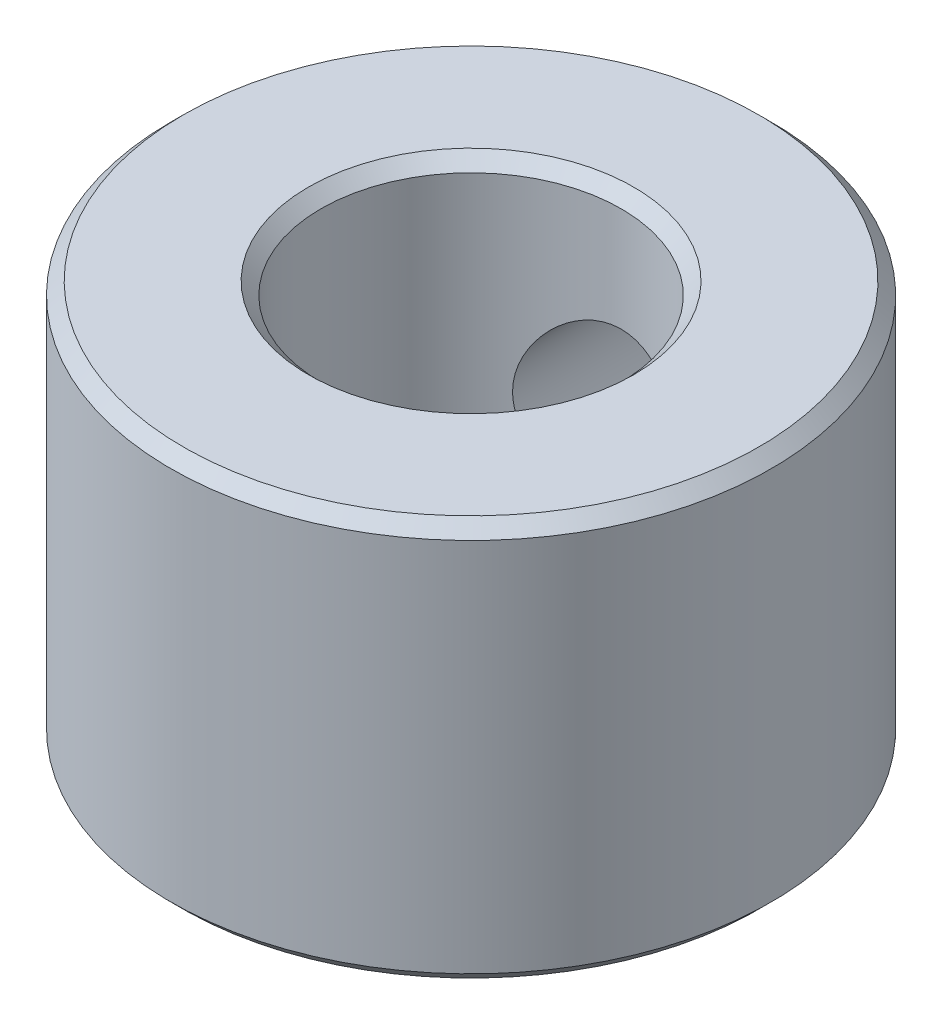
ISO-10303-21;
HEADER;
FILE_DESCRIPTION(('STEP AP214'),'2;1');
FILE_NAME('part.step','',(''),(''),'','','');
FILE_SCHEMA(('AUTOMOTIVE_DESIGN { 1 0 10303 214 1 1 1 1 }'));
ENDSEC;
DATA;
#1=APPLICATION_CONTEXT('core data for automotive mechanical design processes');
#2=APPLICATION_PROTOCOL_DEFINITION('international standard','automotive_design',2000,#1);
#3=PRODUCT_CONTEXT('',#1,'mechanical');
#4=PRODUCT('Part','Part','',(#3));
#5=PRODUCT_RELATED_PRODUCT_CATEGORY('part','',(#4));
#6=PRODUCT_DEFINITION_FORMATION('','',#4);
#7=PRODUCT_DEFINITION_CONTEXT('part definition',#1,'design');
#8=PRODUCT_DEFINITION('design','',#6,#7);
#9=PRODUCT_DEFINITION_SHAPE('','',#8);
#10=(LENGTH_UNIT() NAMED_UNIT(*) SI_UNIT(.MILLI.,.METRE.));
#11=(NAMED_UNIT(*) PLANE_ANGLE_UNIT() SI_UNIT($,.RADIAN.));
#12=(NAMED_UNIT(*) SI_UNIT($,.STERADIAN.) SOLID_ANGLE_UNIT());
#13=UNCERTAINTY_MEASURE_WITH_UNIT(LENGTH_MEASURE(1.E-05),#10,'distance_accuracy_value','');
#14=(GEOMETRIC_REPRESENTATION_CONTEXT(3) GLOBAL_UNCERTAINTY_ASSIGNED_CONTEXT((#13)) GLOBAL_UNIT_ASSIGNED_CONTEXT((#10,
#11,#12)) REPRESENTATION_CONTEXT('',''));
#15=CARTESIAN_POINT('',(0.,0.,0.));
#16=DIRECTION('',(0.,0.,1.));
#17=DIRECTION('',(1.,0.,0.));
#18=AXIS2_PLACEMENT_3D('',#15,#16,#17);
#19=CARTESIAN_POINT('',(0.,7.875,0.));
#20=DIRECTION('',(0.,1.,0.));
#21=DIRECTION('',(1.,0.,0.));
#22=AXIS2_PLACEMENT_3D('',#19,#20,#21);
#23=CONICAL_SURFACE('',#22,3.125,0.785398163397448);
#24=CARTESIAN_POINT('',(0.,8.,0.));
#25=DIRECTION('',(0.,1.,0.));
#26=DIRECTION('',(1.,0.,0.));
#27=AXIS2_PLACEMENT_3D('',#24,#25,#26);
#28=CIRCLE('',#27,3.25);
#29=CARTESIAN_POINT('',(-3.25,8.,0.));
#30=VERTEX_POINT('',#29);
#31=EDGE_CURVE('E64',#30,#30,#28,.T.);
#32=ORIENTED_EDGE('',*,*,#31,.T.);
#33=DIRECTION('',(0.707106781186548,-0.707106781186548,0.));
#34=VECTOR('',#33,1.);
#35=CARTESIAN_POINT('',(-3.125,7.875,0.));
#36=LINE('',#35,#34);
#37=CARTESIAN_POINT('',(-3.,7.75,0.));
#38=VERTEX_POINT('',#37);
#39=EDGE_CURVE('E11',#30,#38,#36,.T.);
#40=ORIENTED_EDGE('',*,*,#39,.T.);
#41=CARTESIAN_POINT('',(0.,7.75,0.));
#42=DIRECTION('',(0.,-1.,0.));
#43=DIRECTION('',(1.,0.,0.));
#44=AXIS2_PLACEMENT_3D('',#41,#42,#43);
#45=CIRCLE('',#44,3.);
#46=EDGE_CURVE('E66',#38,#38,#45,.T.);
#47=ORIENTED_EDGE('',*,*,#46,.T.);
#48=ORIENTED_EDGE('',*,*,#39,.F.);
#49=EDGE_LOOP('',(#32,#40,#47,#48));
#50=FACE_BOUND('',#49,.T.);
#51=ADVANCED_FACE('F17',(#50),#23,.F.);
#52=CARTESIAN_POINT('',(0.,0.,0.));
#53=DIRECTION('',(0.,1.,0.));
#54=DIRECTION('',(1.,0.,0.));
#55=AXIS2_PLACEMENT_3D('',#52,#53,#54);
#56=CYLINDRICAL_SURFACE('',#55,3.);
#57=CARTESIAN_POINT('',(1.666,4.,-2.49488356441739));
#58=CARTESIAN_POINT('',(1.66599358797548,3.91477985266342,-2.49489260336792));
#59=CARTESIAN_POINT('',(1.65941553809322,3.82948914629721,-2.49931938230171));
#60=CARTESIAN_POINT('',(1.63349951074715,3.66165471743543,-2.51632717863311));
#61=CARTESIAN_POINT('',(1.61414053460802,3.5791157508009,-2.52892161464011));
#62=CARTESIAN_POINT('',(1.5638395902299,3.41955186404383,-2.56032611767734));
#63=CARTESIAN_POINT('',(1.53297112271899,3.3424955724092,-2.57909665596888));
#64=CARTESIAN_POINT('',(1.46075367523216,3.19468665429575,-2.62067370744755));
#65=CARTESIAN_POINT('',(1.41940237293022,3.12393542931678,-2.6434811146084));
#66=CARTESIAN_POINT('',(1.32240569230865,2.98271223173281,-2.69342025267058));
#67=CARTESIAN_POINT('',(1.2657255626089,2.91302260591041,-2.72075534915385));
#68=CARTESIAN_POINT('',(1.14181562615119,2.78350839499414,-2.77503808161237));
#69=CARTESIAN_POINT('',(1.07457941338979,2.72368984571332,-2.80198547139491));
#70=CARTESIAN_POINT('',(0.924260864059354,2.61042884147393,-2.85528251894713));
#71=CARTESIAN_POINT('',(0.840304609575793,2.55801129205886,-2.8813707142365));
#72=CARTESIAN_POINT('',(0.663041866825624,2.46840948326987,-2.92723922365313));
#73=CARTESIAN_POINT('',(0.569742712547406,2.43121339023754,-2.947024435265));
#74=CARTESIAN_POINT('',(0.384782712040213,2.37642421215793,-2.97656815459226));
#75=CARTESIAN_POINT('',(0.293649263408615,2.35744058725583,-2.98703248437123));
#76=CARTESIAN_POINT('',(0.108944335324914,2.33497080155424,-2.99944548108742));
#77=CARTESIAN_POINT('',(0.0153748053112129,2.33147261027507,-3.00140075860291));
#78=CARTESIAN_POINT('',(-0.16081396915684,2.33968868818927,-2.99684408672755));
#79=CARTESIAN_POINT('',(-0.243536373868867,2.34981968431263,-2.99121329090844));
#80=CARTESIAN_POINT('',(-0.405883431829419,2.38208026884742,-2.97353766084608));
#81=CARTESIAN_POINT('',(-0.485507845821044,2.40421078201442,-2.96149233226131));
#82=CARTESIAN_POINT('',(-0.640519606934136,2.45982253925287,-2.93189913528604));
#83=CARTESIAN_POINT('',(-0.715854691350193,2.49341866961259,-2.91429571352989));
#84=CARTESIAN_POINT('',(-0.859959853672818,2.57076244562613,-2.87507459117642));
#85=CARTESIAN_POINT('',(-0.928727858251405,2.6145132824194,-2.85345562911396));
#86=CARTESIAN_POINT('',(-1.06577970197285,2.71635915760136,-2.80534245147123));
#87=CARTESIAN_POINT('',(-1.13319084789817,2.77549880452737,-2.77857365864566));
#88=CARTESIAN_POINT('',(-1.25765822202727,2.90371151395101,-2.72450191339833));
#89=CARTESIAN_POINT('',(-1.31470336917321,2.97279506660858,-2.69719842352157));
#90=CARTESIAN_POINT('',(-1.42198619658776,3.12646305004331,-2.64232937587938));
#91=CARTESIAN_POINT('',(-1.47113872039711,3.21188482429738,-2.61496423341264));
#92=CARTESIAN_POINT('',(-1.55405615765774,3.39154079239216,-2.56656024361184));
#93=CARTESIAN_POINT('',(-1.58783889938915,3.48576462245687,-2.54551407623152));
#94=CARTESIAN_POINT('',(-1.63611967432323,3.67258098180218,-2.51473239797486));
#95=CARTESIAN_POINT('',(-1.65195082733331,3.7646946069493,-2.50422298031446));
#96=CARTESIAN_POINT('',(-1.66788254751411,3.95082266511278,-2.49364719824089));
#97=CARTESIAN_POINT('',(-1.6680020936346,4.04483466760228,-2.49356823428474));
#98=CARTESIAN_POINT('',(-1.65372605663552,4.21695362995099,-2.50304385034231));
#99=CARTESIAN_POINT('',(-1.64149887673717,4.29533630518328,-2.5111592746966));
#100=CARTESIAN_POINT('',(-1.6063648394577,4.44871025445074,-2.53377692720028));
#101=CARTESIAN_POINT('',(-1.58345311045656,4.52369996433549,-2.54828206857383));
#102=CARTESIAN_POINT('',(-1.52669995166952,4.67178434718811,-2.58269727945464));
#103=CARTESIAN_POINT('',(-1.49244633801565,4.74467296448406,-2.60280576955496));
#104=CARTESIAN_POINT('',(-1.41432271675274,4.88410500346295,-2.64606969693511));
#105=CARTESIAN_POINT('',(-1.37044801248593,4.95064530328769,-2.66922662013199));
#106=CARTESIAN_POINT('',(-1.26606197905479,5.08680508492553,-2.7204755262081));
#107=CARTESIAN_POINT('',(-1.20400661612348,5.1551744440676,-2.74875888765989));
#108=CARTESIAN_POINT('',(-1.06911420888436,5.28104100592588,-2.80398113234207));
#109=CARTESIAN_POINT('',(-0.99627056483651,5.33853150410626,-2.83091917899014));
#110=CARTESIAN_POINT('',(-0.836866256287972,5.44388783165899,-2.88219095726381));
#111=CARTESIAN_POINT('',(-0.749779202215337,5.49107144939277,-2.90630730158732));
#112=CARTESIAN_POINT('',(-0.567191695958453,5.56961666075203,-2.9473742512374));
#113=CARTESIAN_POINT('',(-0.47170024396347,5.60099494369904,-2.96433241202306));
#114=CARTESIAN_POINT('',(-0.285565858980921,5.64382832616483,-2.98769660569953));
#115=CARTESIAN_POINT('',(-0.195431964419835,5.65699840301882,-2.99500738625835));
#116=CARTESIAN_POINT('',(-0.0139507987378722,5.66841628879618,-3.00133807389089));
#117=CARTESIAN_POINT('',(0.0773957773018482,5.66667230619105,-3.00036254162713));
#118=CARTESIAN_POINT('',(0.249754112191072,5.6492384746268,-2.99071736763623));
#119=CARTESIAN_POINT('',(0.330943114421769,5.63484729254125,-2.9827643299101));
#120=CARTESIAN_POINT('',(0.489550159021802,5.59455122557547,-2.96087014648757));
#121=CARTESIAN_POINT('',(0.566967758542613,5.56864499216472,-2.94692829944667));
#122=CARTESIAN_POINT('',(0.718781508727847,5.50529062986968,-2.9136907377414));
#123=CARTESIAN_POINT('',(0.792994391216897,5.46749073510009,-2.8942339361386));
#124=CARTESIAN_POINT('',(0.934258722942959,5.38186369800929,-2.85177308509422));
#125=CARTESIAN_POINT('',(1.0013073309836,5.33403259964443,-2.82876763710912));
#126=CARTESIAN_POINT('',(1.13462739551163,5.22332891201412,-2.77817837869286));
#127=CARTESIAN_POINT('',(1.19990057492365,5.15935370328744,-2.7503733172773));
#128=CARTESIAN_POINT('',(1.31929491142836,5.02144388449248,-2.6951435657763));
#129=CARTESIAN_POINT('',(1.37340208530237,4.94749697605918,-2.66771939226332));
#130=CARTESIAN_POINT('',(1.4725833201112,4.78531383848755,-2.61436178765839));
#131=CARTESIAN_POINT('',(1.51675134706968,4.69643768351755,-2.58866984679543));
#132=CARTESIAN_POINT('',(1.58889600943455,4.5106989671814,-2.54503780776351));
#133=CARTESIAN_POINT('',(1.6169236572775,4.41386268545983,-2.52707333263277));
#134=CARTESIAN_POINT('',(1.64593215852153,4.26312837994793,-2.50819366046606));
#135=CARTESIAN_POINT('',(1.65343787023449,4.2109198270874,-2.50323378170796));
#136=CARTESIAN_POINT('',(1.66347365398638,4.10581656274678,-2.49657601094835));
#137=CARTESIAN_POINT('',(1.66600398188041,4.05292188669084,-2.49487795121052));
#138=CARTESIAN_POINT('',(1.666,4.,-2.49488356441739));
#139=B_SPLINE_CURVE_WITH_KNOTS('',3,(#57,#58,#59,#60,#61,#62,#63,#64,#65,#66,#67,#68,#69,#70,
#71,#72,#73,#74,#75,#76,#77,#78,#79,#80,#81,#82,#83,#84,#85,#86,#87,#88,#89,#90,#91,#92,#93,#94,
#95,#96,#97,#98,#99,#100,#101,#102,#103,#104,#105,#106,#107,#108,#109,#110,#111,#112,#113,#114,
#115,#116,#117,#118,#119,#120,#121,#122,#123,#124,#125,#126,#127,#128,#129,#130,#131,#132,#133,
#134,#135,#136,#137,#138),.UNSPECIFIED.,.T.,.F.,(4,2,2,2,2,2,2,2,2,2,2,2,2,2,2,2,2,2,2,2,2,2,2,
2,2,2,2,2,2,2,2,2,2,2,2,2,2,2,2,2,4),(0.,0.255435424370881,0.511291569299211,0.765541023080697,
1.0198468515839,1.30039721949375,1.58111850338752,1.88655279792991,2.19174918466576,
2.47116392266437,2.75036154798664,2.99977013654116,3.24919794876686,3.50120223033025,
3.75328581228803,4.03289348465543,4.3127983162654,4.61806502117365,4.92297672146117,
5.20335136727805,5.48338732938646,5.72153735086344,5.95979606316495,6.2078913680111,
6.45610805442096,6.74457164147654,7.03321243092302,7.33734559614323,7.64115694135839,
7.91377086805001,8.18623476184336,8.43361505495999,8.68102432648028,8.93657534215329,
9.19222733060418,9.47762750041566,9.76338293733526,10.0692888199437,10.3742224898719,
10.5328565713711,10.6914824950273),.UNSPECIFIED.);
#140=CARTESIAN_POINT('',(-1.666,4.,-2.49488356441739));
#141=VERTEX_POINT('',#140);
#142=EDGE_CURVE('E81',#141,#141,#139,.T.);
#143=ORIENTED_EDGE('',*,*,#142,.T.);
#144=EDGE_LOOP('',(#143));
#145=FACE_BOUND('',#144,.T.);
#146=ORIENTED_EDGE('',*,*,#46,.F.);
#147=DIRECTION('',(0.,-1.,0.));
#148=VECTOR('',#147,1.);
#149=CARTESIAN_POINT('',(-3.,0.,0.));
#150=LINE('',#149,#148);
#151=CARTESIAN_POINT('',(-3.,0.25,0.));
#152=VERTEX_POINT('',#151);
#153=EDGE_CURVE('E27',#38,#152,#150,.T.);
#154=ORIENTED_EDGE('',*,*,#153,.T.);
#155=CARTESIAN_POINT('',(0.,0.25,0.));
#156=DIRECTION('',(0.,1.,0.));
#157=DIRECTION('',(1.,0.,0.));
#158=AXIS2_PLACEMENT_3D('',#155,#156,#157);
#159=CIRCLE('',#158,3.);
#160=EDGE_CURVE('E77',#152,#152,#159,.T.);
#161=ORIENTED_EDGE('',*,*,#160,.F.);
#162=ORIENTED_EDGE('',*,*,#153,.F.);
#163=EDGE_LOOP('',(#146,#154,#161,#162));
#164=FACE_BOUND('',#163,.T.);
#165=ADVANCED_FACE('F94',(#145,#164),#56,.F.);
#166=CARTESIAN_POINT('',(0.,0.125,0.));
#167=DIRECTION('',(0.,-1.,0.));
#168=DIRECTION('',(1.,0.,0.));
#169=AXIS2_PLACEMENT_3D('',#166,#167,#168);
#170=CONICAL_SURFACE('',#169,3.125,0.785398163397449);
#171=ORIENTED_EDGE('',*,*,#160,.T.);
#172=DIRECTION('',(-0.707106781186548,-0.707106781186547,0.));
#173=VECTOR('',#172,1.);
#174=CARTESIAN_POINT('',(-3.125,0.125,0.));
#175=LINE('',#174,#173);
#176=CARTESIAN_POINT('',(-3.25,0.,0.));
#177=VERTEX_POINT('',#176);
#178=EDGE_CURVE('E69',#152,#177,#175,.T.);
#179=ORIENTED_EDGE('',*,*,#178,.T.);
#180=CARTESIAN_POINT('',(0.,0.,0.));
#181=DIRECTION('',(0.,-1.,0.));
#182=DIRECTION('',(1.,0.,0.));
#183=AXIS2_PLACEMENT_3D('',#180,#181,#182);
#184=CIRCLE('',#183,3.25);
#185=EDGE_CURVE('E161',#177,#177,#184,.T.);
#186=ORIENTED_EDGE('',*,*,#185,.T.);
#187=ORIENTED_EDGE('',*,*,#178,.F.);
#188=EDGE_LOOP('',(#171,#179,#186,#187));
#189=FACE_BOUND('',#188,.T.);
#190=ADVANCED_FACE('F171',(#189),#170,.F.);
#191=CARTESIAN_POINT('',(0.,8.,0.));
#192=DIRECTION('',(0.,1.,0.));
#193=DIRECTION('',(1.,0.,0.));
#194=AXIS2_PLACEMENT_3D('',#191,#192,#193);
#195=PLANE('',#194);
#196=ORIENTED_EDGE('',*,*,#31,.F.);
#197=EDGE_LOOP('',(#196));
#198=FACE_BOUND('',#197,.T.);
#199=CARTESIAN_POINT('',(0.,8.,0.));
#200=DIRECTION('',(0.,-1.,0.));
#201=DIRECTION('',(1.,0.,0.));
#202=AXIS2_PLACEMENT_3D('',#199,#200,#201);
#203=CIRCLE('',#202,5.75);
#204=CARTESIAN_POINT('',(-5.75,8.,0.));
#205=VERTEX_POINT('',#204);
#206=EDGE_CURVE('E154',#205,#205,#203,.T.);
#207=ORIENTED_EDGE('',*,*,#206,.F.);
#208=EDGE_LOOP('',(#207));
#209=FACE_BOUND('',#208,.T.);
#210=ADVANCED_FACE('F179',(#198,#209),#195,.T.);
#211=CARTESIAN_POINT('',(0.,7.875,0.));
#212=DIRECTION('',(0.,-1.,0.));
#213=DIRECTION('',(1.,0.,0.));
#214=AXIS2_PLACEMENT_3D('',#211,#212,#213);
#215=CONICAL_SURFACE('',#214,5.875,0.785398163397448);
#216=ORIENTED_EDGE('',*,*,#206,.T.);
#217=DIRECTION('',(-0.707106781186548,-0.707106781186548,0.));
#218=VECTOR('',#217,1.);
#219=CARTESIAN_POINT('',(-5.875,7.875,0.));
#220=LINE('',#219,#218);
#221=CARTESIAN_POINT('',(-6.,7.75,0.));
#222=VERTEX_POINT('',#221);
#223=EDGE_CURVE('E151',#205,#222,#220,.T.);
#224=ORIENTED_EDGE('',*,*,#223,.T.);
#225=CARTESIAN_POINT('',(0.,7.75,0.));
#226=DIRECTION('',(0.,1.,0.));
#227=DIRECTION('',(1.,0.,0.));
#228=AXIS2_PLACEMENT_3D('',#225,#226,#227);
#229=CIRCLE('',#228,6.);
#230=EDGE_CURVE('E125',#222,#222,#229,.T.);
#231=ORIENTED_EDGE('',*,*,#230,.T.);
#232=ORIENTED_EDGE('',*,*,#223,.F.);
#233=EDGE_LOOP('',(#216,#224,#231,#232));
#234=FACE_BOUND('',#233,.T.);
#235=ADVANCED_FACE('F310',(#234),#215,.T.);
#236=CARTESIAN_POINT('',(0.,0.,0.));
#237=DIRECTION('',(0.,1.,0.));
#238=DIRECTION('',(1.,0.,0.));
#239=AXIS2_PLACEMENT_3D('',#236,#237,#238);
#240=PLANE('',#239);
#241=ORIENTED_EDGE('',*,*,#185,.F.);
#242=EDGE_LOOP('',(#241));
#243=FACE_BOUND('',#242,.T.);
#244=CARTESIAN_POINT('',(0.,0.,0.));
#245=DIRECTION('',(0.,1.,0.));
#246=DIRECTION('',(1.,0.,0.));
#247=AXIS2_PLACEMENT_3D('',#244,#245,#246);
#248=CIRCLE('',#247,5.75);
#249=CARTESIAN_POINT('',(-5.75,0.,0.));
#250=VERTEX_POINT('',#249);
#251=EDGE_CURVE('E158',#250,#250,#248,.T.);
#252=ORIENTED_EDGE('',*,*,#251,.F.);
#253=EDGE_LOOP('',(#252));
#254=FACE_BOUND('',#253,.T.);
#255=ADVANCED_FACE('F301',(#243,#254),#240,.F.);
#256=CARTESIAN_POINT('',(0.,0.125,0.));
#257=DIRECTION('',(0.,1.,0.));
#258=DIRECTION('',(1.,0.,0.));
#259=AXIS2_PLACEMENT_3D('',#256,#257,#258);
#260=CONICAL_SURFACE('',#259,5.875,0.785398163397449);
#261=CARTESIAN_POINT('',(0.,0.25,0.));
#262=DIRECTION('',(0.,-1.,0.));
#263=DIRECTION('',(1.,0.,0.));
#264=AXIS2_PLACEMENT_3D('',#261,#262,#263);
#265=CIRCLE('',#264,6.);
#266=CARTESIAN_POINT('',(-6.,0.25,0.));
#267=VERTEX_POINT('',#266);
#268=EDGE_CURVE('E143',#267,#267,#265,.T.);
#269=ORIENTED_EDGE('',*,*,#268,.T.);
#270=DIRECTION('',(0.707106781186548,-0.707106781186547,0.));
#271=VECTOR('',#270,1.);
#272=CARTESIAN_POINT('',(-5.875,0.125,0.));
#273=LINE('',#272,#271);
#274=EDGE_CURVE('E146',#267,#250,#273,.T.);
#275=ORIENTED_EDGE('',*,*,#274,.T.);
#276=ORIENTED_EDGE('',*,*,#251,.T.);
#277=ORIENTED_EDGE('',*,*,#274,.F.);
#278=EDGE_LOOP('',(#269,#275,#276,#277));
#279=FACE_BOUND('',#278,.T.);
#280=ADVANCED_FACE('F294',(#279),#260,.T.);
#281=CARTESIAN_POINT('',(0.,0.,0.));
#282=DIRECTION('',(0.,1.,0.));
#283=DIRECTION('',(1.,0.,0.));
#284=AXIS2_PLACEMENT_3D('',#281,#282,#283);
#285=CYLINDRICAL_SURFACE('',#284,6.);
#286=CARTESIAN_POINT('',(-1.90467106391259,4.,-5.68965975593392));
#287=CARTESIAN_POINT('',(-1.90467106391259,4.27798805240826,-5.68965975593392));
#288=CARTESIAN_POINT('',(-1.76058783768261,4.87991929576659,-5.73814276389383));
#289=CARTESIAN_POINT('',(-1.24344966544202,5.54314315943468,-5.88505558222578));
#290=CARTESIAN_POINT('',(-0.430470363616678,5.93339114405013,-6.00487143391838));
#291=CARTESIAN_POINT('',(0.430464872014782,5.93510797095324,-6.00625777471834));
#292=CARTESIAN_POINT('',(1.11398359067467,5.60255398011119,-5.90305408249642));
#293=CARTESIAN_POINT('',(1.49559763951059,5.21380181926685,-5.8132931698901));
#294=CARTESIAN_POINT('',(1.96696996628798,4.4699080094172,-5.67530697686264));
#295=CARTESIAN_POINT('',(1.96682059970376,3.52853272448726,-5.67404294827231));
#296=CARTESIAN_POINT('',(1.49556476878775,2.78641966673532,-5.81252886025753));
#297=CARTESIAN_POINT('',(1.11403686877677,2.39774869702648,-5.90233709810603));
#298=CARTESIAN_POINT('',(0.43113487579669,2.06365486666889,-6.00618012294371));
#299=CARTESIAN_POINT('',(-0.430489249134852,2.06673116426778,-6.0047220883988));
#300=CARTESIAN_POINT('',(-1.2432842771573,2.45655711260531,-5.88502648427716));
#301=CARTESIAN_POINT('',(-1.76058819248789,3.12010843888862,-5.73809587718812));
#302=CARTESIAN_POINT('',(-1.90467106391259,3.72201194759174,-5.68965975593392));
#303=CARTESIAN_POINT('',(-1.90467106391259,4.,-5.68965975593392));
#304=(BOUNDED_CURVE() B_SPLINE_CURVE(3,(#286,#287,#288,#289,#290,#291,#292,#293,#294,#295,#296,
#297,#298,#299,#300,#301,#302,#303),.UNSPECIFIED.,.T.,.F.) B_SPLINE_CURVE_WITH_KNOTS((4,1,1,1,1,
1,1,1,1,1,1,1,1,1,1,4),(0.,0.0721317209962181,0.144263441992433,0.216395162988648,
0.288526883984863,0.360658604981077,0.396724465479185,0.432790325977292,0.577053767969721,
0.613119628467829,0.649185488965936,0.721317209962151,0.793448930958366,0.865580651954581,
0.937712372950795,1.00984409394701),
.UNSPECIFIED.) CURVE() GEOMETRIC_REPRESENTATION_ITEM() RATIONAL_B_SPLINE_CURVE((1.,1.,1.,1.,1.,
1.,1.,1.,1.,1.,1.,1.,1.,1.,1.,1.,1.,1.)) REPRESENTATION_ITEM(''));
#305=CARTESIAN_POINT('',(-1.90467106391259,4.,-5.68965975593392));
#306=VERTEX_POINT('',#305);
#307=EDGE_CURVE('E91',#306,#306,#304,.T.);
#308=ORIENTED_EDGE('',*,*,#307,.F.);
#309=EDGE_LOOP('',(#308));
#310=FACE_BOUND('',#309,.T.);
#311=ORIENTED_EDGE('',*,*,#230,.F.);
#312=DIRECTION('',(0.,-1.,0.));
#313=VECTOR('',#312,1.);
#314=CARTESIAN_POINT('',(-6.,0.,0.));
#315=LINE('',#314,#313);
#316=EDGE_CURVE('E134',#222,#267,#315,.T.);
#317=ORIENTED_EDGE('',*,*,#316,.T.);
#318=ORIENTED_EDGE('',*,*,#268,.F.);
#319=ORIENTED_EDGE('',*,*,#316,.F.);
#320=EDGE_LOOP('',(#311,#317,#318,#319));
#321=FACE_BOUND('',#320,.T.);
#322=ADVANCED_FACE('F104',(#310,#321),#285,.T.);
#323=CARTESIAN_POINT('',(0.,4.,0.));
#324=DIRECTION('',(0.,0.,-1.));
#325=DIRECTION('',(1.,0.,0.));
#326=AXIS2_PLACEMENT_3D('',#323,#324,#325);
#327=CYLINDRICAL_SURFACE('',#326,1.666);
#328=ORIENTED_EDGE('',*,*,#142,.F.);
#329=DIRECTION('',(0.,0.,-1.));
#330=VECTOR('',#329,1.);
#331=CARTESIAN_POINT('',(-1.666,4.,0.));
#332=LINE('',#331,#330);
#333=CARTESIAN_POINT('',(-1.666,4.,-5.51406488513098));
#334=VERTEX_POINT('',#333);
#335=EDGE_CURVE('E90',#141,#334,#332,.T.);
#336=ORIENTED_EDGE('',*,*,#335,.T.);
#337=CARTESIAN_POINT('',(-1.666,4.,-5.51406488513098));
#338=CARTESIAN_POINT('',(-1.666,3.74913256588162,-5.51406488513098));
#339=CARTESIAN_POINT('',(-1.52794902093865,3.2068002729572,-5.55248227833268));
#340=CARTESIAN_POINT('',(-1.05143608470322,2.63457087135734,-5.66594324591738));
#341=CARTESIAN_POINT('',(-0.354920467374975,2.31975699810965,-5.75351664248302));
#342=CARTESIAN_POINT('',(0.355195946566027,2.31718477681089,-5.75465632298381));
#343=CARTESIAN_POINT('',(0.941594262623088,2.58754185205266,-5.67835101461279));
#344=CARTESIAN_POINT('',(1.28410641901586,2.91909193204883,-5.60994586771988));
#345=CARTESIAN_POINT('',(1.7222064849146,3.5679219485169,-5.50212382729795));
#346=CARTESIAN_POINT('',(1.72158212392102,4.43073684943282,-5.50322172976706));
#347=CARTESIAN_POINT('',(1.28368486640487,5.08111333431053,-5.61060824599244));
#348=CARTESIAN_POINT('',(0.941148067842879,5.41273739732678,-5.67896808493469));
#349=CARTESIAN_POINT('',(0.354614348883766,5.68166581352496,-5.75470548485607));
#350=CARTESIAN_POINT('',(-0.354990987399066,5.68035613407823,-5.75364590153158));
#351=CARTESIAN_POINT('',(-1.05158528763341,5.36515063068417,-5.66596394489628));
#352=CARTESIAN_POINT('',(-1.52797563034692,4.79322533931472,-5.55252271089453));
#353=CARTESIAN_POINT('',(-1.666,4.25086743411838,-5.51406488513098));
#354=CARTESIAN_POINT('',(-1.666,4.,-5.51406488513098));
#355=(BOUNDED_CURVE() B_SPLINE_CURVE(3,(#337,#338,#339,#340,#341,#342,#343,#344,#345,#346,#347,
#348,#349,#350,#351,#352,#353,#354),.UNSPECIFIED.,.T.,.F.) B_SPLINE_CURVE_WITH_KNOTS((4,1,1,1,1,
1,1,1,1,1,1,1,1,1,1,4),(0.,0.0721317209962147,0.144263441992429,0.216395162988644,
0.288526883984859,0.360658604981074,0.396724465479181,0.432790325977289,0.577053767969718,
0.613119628467825,0.649185488965933,0.721317209962147,0.793448930958362,0.865580651954577,
0.937712372950792,1.00984409394701),
.UNSPECIFIED.) CURVE() GEOMETRIC_REPRESENTATION_ITEM() RATIONAL_B_SPLINE_CURVE((1.,1.,1.,1.,1.,
1.,1.,1.,1.,1.,1.,1.,1.,1.,1.,1.,1.,1.)) REPRESENTATION_ITEM(''));
#356=EDGE_CURVE('E183',#334,#334,#355,.T.);
#357=ORIENTED_EDGE('',*,*,#356,.F.);
#358=ORIENTED_EDGE('',*,*,#335,.F.);
#359=EDGE_LOOP('',(#328,#336,#357,#358));
#360=FACE_BOUND('',#359,.T.);
#361=ADVANCED_FACE('F98',(#360),#327,.F.);
#362=CARTESIAN_POINT('',(-1.90467106391259,4.,-5.68965975593392));
#363=CARTESIAN_POINT('',(-1.90467106391259,3.72201194759174,-5.68965975593392));
#364=CARTESIAN_POINT('',(-1.76058819248789,3.12010843888862,-5.73809587718812));
#365=CARTESIAN_POINT('',(-1.2432842771573,2.45655711260531,-5.88502648427716));
#366=CARTESIAN_POINT('',(-0.430489249134852,2.06673116426778,-6.0047220883988));
#367=CARTESIAN_POINT('',(0.43113487579669,2.06365486666889,-6.00618012294371));
#368=CARTESIAN_POINT('',(1.11403686877677,2.39774869702648,-5.90233709810603));
#369=CARTESIAN_POINT('',(1.49556476878775,2.78641966673532,-5.81252886025753));
#370=CARTESIAN_POINT('',(1.96682059970376,3.52853272448726,-5.67404294827231));
#371=CARTESIAN_POINT('',(1.96696996628798,4.4699080094172,-5.67530697686264));
#372=CARTESIAN_POINT('',(1.49559763951059,5.21380181926685,-5.8132931698901));
#373=CARTESIAN_POINT('',(1.11398359067467,5.60255398011119,-5.90305408249642));
#374=CARTESIAN_POINT('',(0.430464872014782,5.93510797095324,-6.00625777471834));
#375=CARTESIAN_POINT('',(-0.430470363616678,5.93339114405013,-6.00487143391838));
#376=CARTESIAN_POINT('',(-1.24344966544202,5.54314315943468,-5.88505558222578));
#377=CARTESIAN_POINT('',(-1.76058783768261,4.87991929576659,-5.73814276389383));
#378=CARTESIAN_POINT('',(-1.90467106391259,4.27798805240826,-5.68965975593392));
#379=CARTESIAN_POINT('',(-1.90467106391259,4.,-5.68965975593392));
#380=CARTESIAN_POINT('',(-1.8251140426084,4.,-5.63112813233294));
#381=CARTESIAN_POINT('',(-1.8251140426084,3.73105215368837,-5.63112813233294));
#382=CARTESIAN_POINT('',(-1.68304180197148,3.14900571691148,-5.67622467756964));
#383=CARTESIAN_POINT('',(-1.17933487967261,2.51589503218932,-5.81199873815723));
#384=CARTESIAN_POINT('',(-0.405299655214893,2.15107310888174,-5.92098693976021));
#385=CARTESIAN_POINT('',(0.405821899386469,2.14816483671622,-5.92233885629041));
#386=CARTESIAN_POINT('',(1.05655600005888,2.46101308203521,-5.82767507027495));
#387=CARTESIAN_POINT('',(1.42507865219712,2.83064375517315,-5.74500119607831));
#388=CARTESIAN_POINT('',(1.88528256144071,3.54166246583047,-5.61673657461419));
#389=CARTESIAN_POINT('',(1.88517401883232,4.45685095608907,-5.61794522783078));
#390=CARTESIAN_POINT('',(1.42496004847535,5.16957232428141,-5.74573152859088));
#391=CARTESIAN_POINT('',(1.05637174973074,5.53928178584972,-5.82835874997584));
#392=CARTESIAN_POINT('',(0.405181364304443,5.85062725181048,-5.92240701143092));
#393=CARTESIAN_POINT('',(-0.40531057154414,5.84904614072616,-5.92112958978945));
#394=CARTESIAN_POINT('',(-1.17949487283915,5.48381231651785,-5.81202503644928));
#395=CARTESIAN_POINT('',(-1.68305043523738,4.85102131028263,-5.67626941289406));
#396=CARTESIAN_POINT('',(-1.8251140426084,4.26894784631163,-5.63112813233294));
#397=CARTESIAN_POINT('',(-1.8251140426084,4.,-5.63112813233294));
#398=CARTESIAN_POINT('',(-1.7455570213042,4.,-5.57259650873196));
#399=CARTESIAN_POINT('',(-1.7455570213042,3.74009235978499,-5.57259650873196));
#400=CARTESIAN_POINT('',(-1.60549541145506,3.17790299493434,-5.61435347795116));
#401=CARTESIAN_POINT('',(-1.11538548218792,2.57523295177333,-5.73897099203731));
#402=CARTESIAN_POINT('',(-0.380110061294935,2.23541505349569,-5.83725179112161));
#403=CARTESIAN_POINT('',(0.380508922976248,2.23267480676356,-5.83849758963711));
#404=CARTESIAN_POINT('',(0.999075131340984,2.52427746704393,-5.75301304244387));
#405=CARTESIAN_POINT('',(1.35459253560649,2.87486784361099,-5.67747353189909));
#406=CARTESIAN_POINT('',(1.80374452317765,3.55479220717369,-5.55943020095607));
#407=CARTESIAN_POINT('',(1.80337807137667,4.44379390276095,-5.56058347879892));
#408=CARTESIAN_POINT('',(1.35432245744011,5.12534282929597,-5.67816988729166));
#409=CARTESIAN_POINT('',(0.998759908786808,5.47600959158825,-5.75366341745527));
#410=CARTESIAN_POINT('',(0.379897856594105,5.76614653266772,-5.8385562481435));
#411=CARTESIAN_POINT('',(-0.380150779471604,5.7647011374022,-5.83738774566051));
#412=CARTESIAN_POINT('',(-1.11554008023628,5.42448147360101,-5.73899449067278));
#413=CARTESIAN_POINT('',(-1.60551303279215,4.82212332479867,-5.61439606189429));
#414=CARTESIAN_POINT('',(-1.7455570213042,4.25990764021501,-5.57259650873196));
#415=CARTESIAN_POINT('',(-1.7455570213042,4.,-5.57259650873196));
#416=CARTESIAN_POINT('',(-1.666,4.,-5.51406488513098));
#417=CARTESIAN_POINT('',(-1.666,3.74913256588162,-5.51406488513098));
#418=CARTESIAN_POINT('',(-1.52794902093865,3.2068002729572,-5.55248227833268));
#419=CARTESIAN_POINT('',(-1.05143608470322,2.63457087135734,-5.66594324591738));
#420=CARTESIAN_POINT('',(-0.354920467374975,2.31975699810965,-5.75351664248302));
#421=CARTESIAN_POINT('',(0.355195946566027,2.31718477681089,-5.75465632298381));
#422=CARTESIAN_POINT('',(0.941594262623088,2.58754185205266,-5.67835101461279));
#423=CARTESIAN_POINT('',(1.28410641901586,2.91909193204883,-5.60994586771988));
#424=CARTESIAN_POINT('',(1.7222064849146,3.5679219485169,-5.50212382729795));
#425=CARTESIAN_POINT('',(1.72158212392102,4.43073684943282,-5.50322172976706));
#426=CARTESIAN_POINT('',(1.28368486640487,5.08111333431053,-5.61060824599244));
#427=CARTESIAN_POINT('',(0.941148067842879,5.41273739732678,-5.67896808493469));
#428=CARTESIAN_POINT('',(0.354614348883766,5.68166581352496,-5.75470548485607));
#429=CARTESIAN_POINT('',(-0.354990987399066,5.68035613407823,-5.75364590153158));
#430=CARTESIAN_POINT('',(-1.05158528763341,5.36515063068417,-5.66596394489628));
#431=CARTESIAN_POINT('',(-1.52797563034692,4.79322533931472,-5.55252271089453));
#432=CARTESIAN_POINT('',(-1.666,4.25086743411838,-5.51406488513098));
#433=CARTESIAN_POINT('',(-1.666,4.,-5.51406488513098));
#434=(BOUNDED_SURFACE() B_SPLINE_SURFACE(3,3,((#362,#363,#364,#365,#366,#367,#368,#369,#370,
#371,#372,#373,#374,#375,#376,#377,#378,#379),(#380,#381,#382,#383,#384,#385,#386,#387,#388,
#389,#390,#391,#392,#393,#394,#395,#396,#397),(#398,#399,#400,#401,#402,#403,#404,#405,#406,
#407,#408,#409,#410,#411,#412,#413,#414,#415),(#416,#417,#418,#419,#420,#421,#422,#423,#424,
#425,#426,#427,#428,#429,#430,#431,#432,#433)),.UNSPECIFIED.,.F.,.T.,
.F.) B_SPLINE_SURFACE_WITH_KNOTS((4,4),(4,1,1,1,1,1,1,1,1,1,1,1,1,1,1,4),(0.,1.),(0.,
0.0721317209962147,0.144263441992429,0.216395162988644,0.288526883984859,0.360658604981074,
0.396724465479181,0.432790325977289,0.577053767969718,0.613119628467825,0.649185488965933,
0.721317209962147,0.793448930958362,0.865580651954577,0.937712372950792,1.00984409394701),
.UNSPECIFIED.) GEOMETRIC_REPRESENTATION_ITEM() RATIONAL_B_SPLINE_SURFACE(((1.,1.,1.,1.,1.,1.,1.,
1.,1.,1.,1.,1.,1.,1.,1.,1.,1.,1.),(1.,1.,1.,1.,1.,1.,1.,1.,1.,1.,1.,1.,1.,1.,1.,1.,1.,1.),(1.,
1.,1.,1.,1.,1.,1.,1.,1.,1.,1.,1.,1.,1.,1.,1.,1.,1.),(1.,1.,1.,1.,1.,1.,1.,1.,1.,1.,1.,1.,1.,1.,
1.,1.,1.,1.))) REPRESENTATION_ITEM('') SURFACE());
#435=DIRECTION('',(0.805487590465619,0.,0.59261264043715));
#436=VECTOR('',#435,1.);
#437=CARTESIAN_POINT('',(-1.90467106391259,4.,-5.68965975593392));
#438=LINE('',#437,#436);
#439=EDGE_CURVE('E191',#306,#334,#438,.T.);
#440=ORIENTED_EDGE('',*,*,#439,.T.);
#441=ORIENTED_EDGE('',*,*,#356,.T.);
#442=ORIENTED_EDGE('',*,*,#439,.F.);
#443=ORIENTED_EDGE('',*,*,#307,.T.);
#444=EDGE_LOOP('',(#440,#441,#442,#443));
#445=FACE_BOUND('',#444,.T.);
#446=ADVANCED_FACE('F103',(#445),#434,.T.);
#447=CLOSED_SHELL('',(#51,#165,#190,#210,#235,#255,#280,#322,#361,#446));
#448=MANIFOLD_SOLID_BREP('B1',#447);
#449=ADVANCED_BREP_SHAPE_REPRESENTATION('',(#18,#448),#14);
#450=SHAPE_DEFINITION_REPRESENTATION(#9,#449);
ENDSEC;
END-ISO-10303-21;
